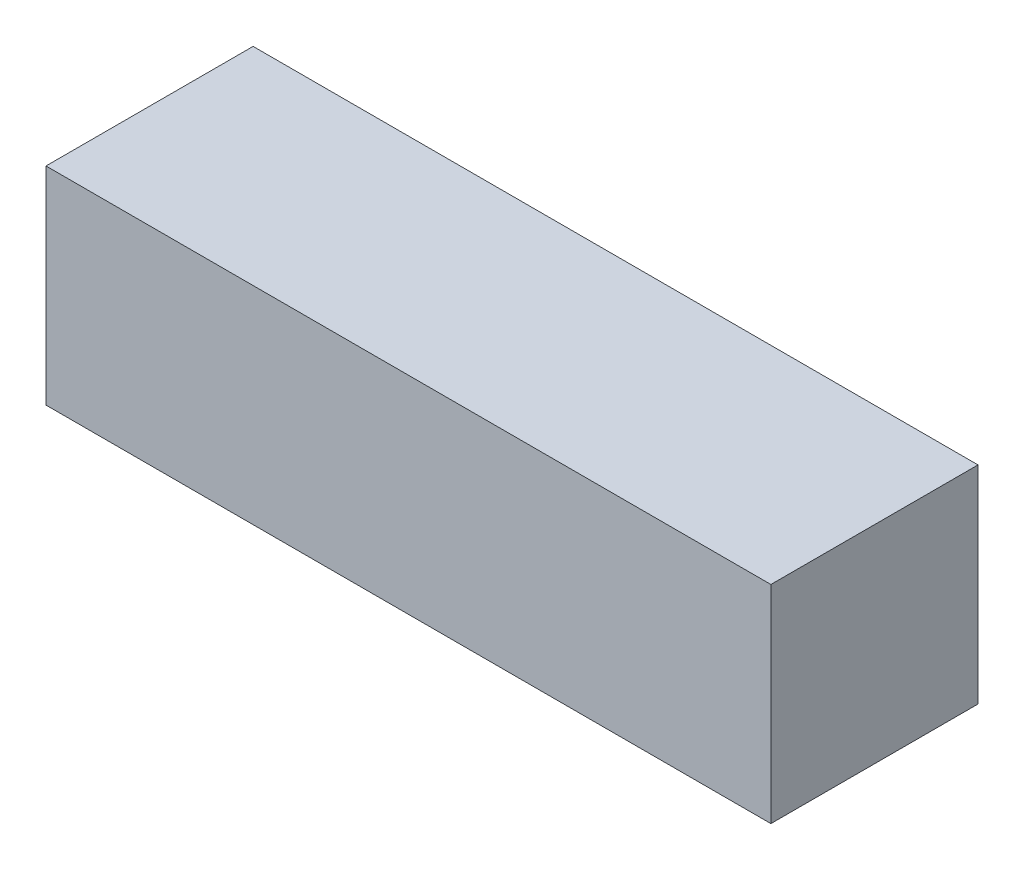
ISO-10303-21;
HEADER;
FILE_DESCRIPTION(('STEP AP214'),'2;1');
FILE_NAME('part.step','',(''),(''),'','','');
FILE_SCHEMA(('AUTOMOTIVE_DESIGN { 1 0 10303 214 1 1 1 1 }'));
ENDSEC;
DATA;
#1=APPLICATION_CONTEXT('core data for automotive mechanical design processes');
#2=APPLICATION_PROTOCOL_DEFINITION('international standard','automotive_design',2000,#1);
#3=PRODUCT_CONTEXT('',#1,'mechanical');
#4=PRODUCT('Part','Part','',(#3));
#5=PRODUCT_RELATED_PRODUCT_CATEGORY('part','',(#4));
#6=PRODUCT_DEFINITION_FORMATION('','',#4);
#7=PRODUCT_DEFINITION_CONTEXT('part definition',#1,'design');
#8=PRODUCT_DEFINITION('design','',#6,#7);
#9=PRODUCT_DEFINITION_SHAPE('','',#8);
#10=(LENGTH_UNIT() NAMED_UNIT(*) SI_UNIT(.MILLI.,.METRE.));
#11=(NAMED_UNIT(*) PLANE_ANGLE_UNIT() SI_UNIT($,.RADIAN.));
#12=(NAMED_UNIT(*) SI_UNIT($,.STERADIAN.) SOLID_ANGLE_UNIT());
#13=UNCERTAINTY_MEASURE_WITH_UNIT(LENGTH_MEASURE(1.E-05),#10,'distance_accuracy_value','');
#14=(GEOMETRIC_REPRESENTATION_CONTEXT(3) GLOBAL_UNCERTAINTY_ASSIGNED_CONTEXT((#13)) GLOBAL_UNIT_ASSIGNED_CONTEXT((#10,
#11,#12)) REPRESENTATION_CONTEXT('',''));
#15=CARTESIAN_POINT('',(0.,0.,0.));
#16=DIRECTION('',(0.,0.,1.));
#17=DIRECTION('',(1.,0.,0.));
#18=AXIS2_PLACEMENT_3D('',#15,#16,#17);
#19=CARTESIAN_POINT('',(35.,0.,0.));
#20=DIRECTION('',(0.,0.,-1.));
#21=DIRECTION('',(-1.,0.,0.));
#22=AXIS2_PLACEMENT_3D('',#19,#20,#21);
#23=PLANE('',#22);
#24=DIRECTION('',(0.,-1.,0.));
#25=VECTOR('',#24,1.);
#26=CARTESIAN_POINT('',(0.,0.,0.));
#27=LINE('',#26,#25);
#28=CARTESIAN_POINT('',(0.,10.,0.));
#29=VERTEX_POINT('',#28);
#30=CARTESIAN_POINT('',(0.,0.,0.));
#31=VERTEX_POINT('',#30);
#32=EDGE_CURVE('E96',#29,#31,#27,.T.);
#33=ORIENTED_EDGE('',*,*,#32,.T.);
#34=DIRECTION('',(-1.,0.,0.));
#35=VECTOR('',#34,1.);
#36=CARTESIAN_POINT('',(35.,0.,0.));
#37=LINE('',#36,#35);
#38=CARTESIAN_POINT('',(35.,0.,0.));
#39=VERTEX_POINT('',#38);
#40=EDGE_CURVE('E11',#39,#31,#37,.T.);
#41=ORIENTED_EDGE('',*,*,#40,.F.);
#42=DIRECTION('',(0.,-1.,0.));
#43=VECTOR('',#42,1.);
#44=CARTESIAN_POINT('',(35.,0.,0.));
#45=LINE('',#44,#43);
#46=CARTESIAN_POINT('',(35.,10.,0.));
#47=VERTEX_POINT('',#46);
#48=EDGE_CURVE('E84',#47,#39,#45,.T.);
#49=ORIENTED_EDGE('',*,*,#48,.F.);
#50=DIRECTION('',(-1.,0.,0.));
#51=VECTOR('',#50,1.);
#52=CARTESIAN_POINT('',(35.,10.,0.));
#53=LINE('',#52,#51);
#54=EDGE_CURVE('E92',#47,#29,#53,.T.);
#55=ORIENTED_EDGE('',*,*,#54,.T.);
#56=EDGE_LOOP('',(#33,#41,#49,#55));
#57=FACE_BOUND('',#56,.T.);
#58=ADVANCED_FACE('F33',(#57),#23,.F.);
#59=CARTESIAN_POINT('',(35.,0.,0.));
#60=DIRECTION('',(0.,1.,0.));
#61=DIRECTION('',(0.,0.,1.));
#62=AXIS2_PLACEMENT_3D('',#59,#60,#61);
#63=PLANE('',#62);
#64=DIRECTION('',(0.,0.,-1.));
#65=VECTOR('',#64,1.);
#66=CARTESIAN_POINT('',(0.,0.,0.));
#67=LINE('',#66,#65);
#68=CARTESIAN_POINT('',(0.,0.,-10.));
#69=VERTEX_POINT('',#68);
#70=EDGE_CURVE('E88',#31,#69,#67,.T.);
#71=ORIENTED_EDGE('',*,*,#70,.T.);
#72=DIRECTION('',(-1.,0.,0.));
#73=VECTOR('',#72,1.);
#74=CARTESIAN_POINT('',(35.,0.,-10.));
#75=LINE('',#74,#73);
#76=CARTESIAN_POINT('',(35.,0.,-10.));
#77=VERTEX_POINT('',#76);
#78=EDGE_CURVE('E41',#77,#69,#75,.T.);
#79=ORIENTED_EDGE('',*,*,#78,.F.);
#80=DIRECTION('',(0.,0.,-1.));
#81=VECTOR('',#80,1.);
#82=CARTESIAN_POINT('',(35.,0.,0.));
#83=LINE('',#82,#81);
#84=EDGE_CURVE('E79',#39,#77,#83,.T.);
#85=ORIENTED_EDGE('',*,*,#84,.F.);
#86=ORIENTED_EDGE('',*,*,#40,.T.);
#87=EDGE_LOOP('',(#71,#79,#85,#86));
#88=FACE_BOUND('',#87,.T.);
#89=ADVANCED_FACE('F87',(#88),#63,.F.);
#90=CARTESIAN_POINT('',(35.,0.,-10.));
#91=DIRECTION('',(0.,0.,1.));
#92=DIRECTION('',(1.,0.,0.));
#93=AXIS2_PLACEMENT_3D('',#90,#91,#92);
#94=PLANE('',#93);
#95=DIRECTION('',(0.,1.,0.));
#96=VECTOR('',#95,1.);
#97=CARTESIAN_POINT('',(0.,0.,-10.));
#98=LINE('',#97,#96);
#99=CARTESIAN_POINT('',(0.,10.,-10.));
#100=VERTEX_POINT('',#99);
#101=EDGE_CURVE('E66',#69,#100,#98,.T.);
#102=ORIENTED_EDGE('',*,*,#101,.T.);
#103=DIRECTION('',(-1.,0.,0.));
#104=VECTOR('',#103,1.);
#105=CARTESIAN_POINT('',(35.,10.,-10.));
#106=LINE('',#105,#104);
#107=CARTESIAN_POINT('',(35.,10.,-10.));
#108=VERTEX_POINT('',#107);
#109=EDGE_CURVE('E89',#108,#100,#106,.T.);
#110=ORIENTED_EDGE('',*,*,#109,.F.);
#111=DIRECTION('',(0.,1.,0.));
#112=VECTOR('',#111,1.);
#113=CARTESIAN_POINT('',(35.,0.,-10.));
#114=LINE('',#113,#112);
#115=EDGE_CURVE('E82',#77,#108,#114,.T.);
#116=ORIENTED_EDGE('',*,*,#115,.F.);
#117=ORIENTED_EDGE('',*,*,#78,.T.);
#118=EDGE_LOOP('',(#102,#110,#116,#117));
#119=FACE_BOUND('',#118,.T.);
#120=ADVANCED_FACE('F90',(#119),#94,.F.);
#121=CARTESIAN_POINT('',(35.,10.,0.));
#122=DIRECTION('',(0.,-1.,0.));
#123=DIRECTION('',(0.,0.,-1.));
#124=AXIS2_PLACEMENT_3D('',#121,#122,#123);
#125=PLANE('',#124);
#126=DIRECTION('',(0.,0.,1.));
#127=VECTOR('',#126,1.);
#128=CARTESIAN_POINT('',(0.,10.,0.));
#129=LINE('',#128,#127);
#130=EDGE_CURVE('E72',#100,#29,#129,.T.);
#131=ORIENTED_EDGE('',*,*,#130,.T.);
#132=ORIENTED_EDGE('',*,*,#54,.F.);
#133=DIRECTION('',(0.,0.,1.));
#134=VECTOR('',#133,1.);
#135=CARTESIAN_POINT('',(35.,10.,0.));
#136=LINE('',#135,#134);
#137=EDGE_CURVE('E49',#108,#47,#136,.T.);
#138=ORIENTED_EDGE('',*,*,#137,.F.);
#139=ORIENTED_EDGE('',*,*,#109,.T.);
#140=EDGE_LOOP('',(#131,#132,#138,#139));
#141=FACE_BOUND('',#140,.T.);
#142=ADVANCED_FACE('F103',(#141),#125,.F.);
#143=CARTESIAN_POINT('',(35.,0.,0.));
#144=DIRECTION('',(-1.,0.,0.));
#145=DIRECTION('',(0.,0.,1.));
#146=AXIS2_PLACEMENT_3D('',#143,#144,#145);
#147=PLANE('',#146);
#148=ORIENTED_EDGE('',*,*,#48,.T.);
#149=ORIENTED_EDGE('',*,*,#84,.T.);
#150=ORIENTED_EDGE('',*,*,#115,.T.);
#151=ORIENTED_EDGE('',*,*,#137,.T.);
#152=EDGE_LOOP('',(#148,#149,#150,#151));
#153=FACE_BOUND('',#152,.T.);
#154=ADVANCED_FACE('F80',(#153),#147,.F.);
#155=CARTESIAN_POINT('',(0.,0.,0.));
#156=DIRECTION('',(-1.,0.,0.));
#157=DIRECTION('',(0.,0.,1.));
#158=AXIS2_PLACEMENT_3D('',#155,#156,#157);
#159=PLANE('',#158);
#160=ORIENTED_EDGE('',*,*,#32,.F.);
#161=ORIENTED_EDGE('',*,*,#130,.F.);
#162=ORIENTED_EDGE('',*,*,#101,.F.);
#163=ORIENTED_EDGE('',*,*,#70,.F.);
#164=EDGE_LOOP('',(#160,#161,#162,#163));
#165=FACE_BOUND('',#164,.T.);
#166=ADVANCED_FACE('F106',(#165),#159,.T.);
#167=CLOSED_SHELL('',(#58,#89,#120,#142,#154,#166));
#168=MANIFOLD_SOLID_BREP('B2',#167);
#169=ADVANCED_BREP_SHAPE_REPRESENTATION('',(#18,#168),#14);
#170=SHAPE_DEFINITION_REPRESENTATION(#9,#169);
ENDSEC;
END-ISO-10303-21;
